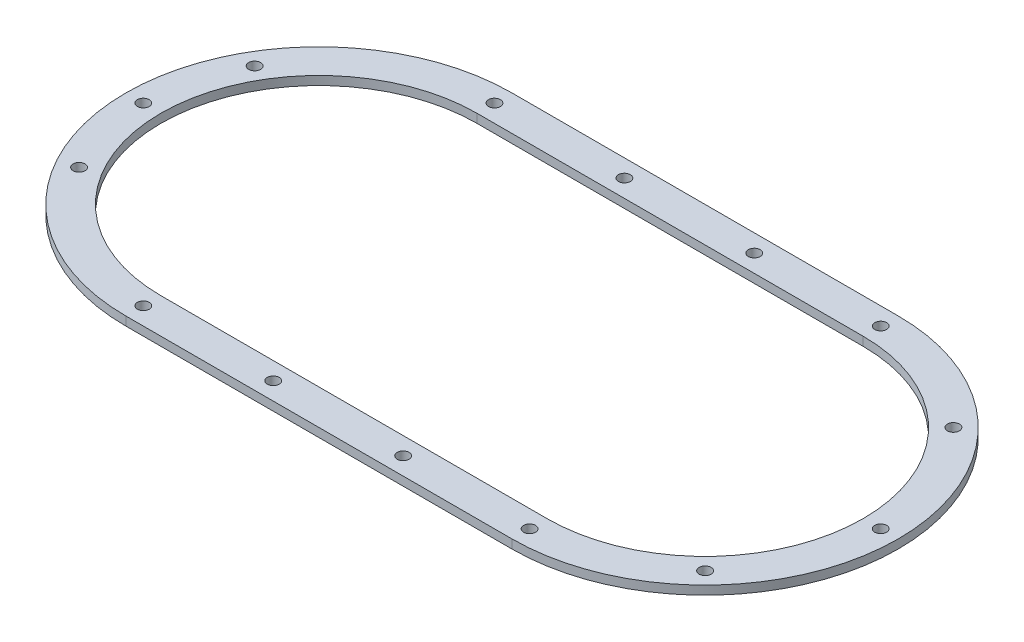
ISO-10303-21;
HEADER;
FILE_DESCRIPTION(('STEP AP214'),'2;1');
FILE_NAME('part.step','',(''),(''),'','','');
FILE_SCHEMA(('AUTOMOTIVE_DESIGN { 1 0 10303 214 1 1 1 1 }'));
ENDSEC;
DATA;
#1=APPLICATION_CONTEXT('core data for automotive mechanical design processes');
#2=APPLICATION_PROTOCOL_DEFINITION('international standard','automotive_design',2000,#1);
#3=PRODUCT_CONTEXT('',#1,'mechanical');
#4=PRODUCT('Part','Part','',(#3));
#5=PRODUCT_RELATED_PRODUCT_CATEGORY('part','',(#4));
#6=PRODUCT_DEFINITION_FORMATION('','',#4);
#7=PRODUCT_DEFINITION_CONTEXT('part definition',#1,'design');
#8=PRODUCT_DEFINITION('design','',#6,#7);
#9=PRODUCT_DEFINITION_SHAPE('','',#8);
#10=(LENGTH_UNIT() NAMED_UNIT(*) SI_UNIT(.MILLI.,.METRE.));
#11=(NAMED_UNIT(*) PLANE_ANGLE_UNIT() SI_UNIT($,.RADIAN.));
#12=(NAMED_UNIT(*) SI_UNIT($,.STERADIAN.) SOLID_ANGLE_UNIT());
#13=UNCERTAINTY_MEASURE_WITH_UNIT(LENGTH_MEASURE(1.E-05),#10,'distance_accuracy_value','');
#14=(GEOMETRIC_REPRESENTATION_CONTEXT(3) GLOBAL_UNCERTAINTY_ASSIGNED_CONTEXT((#13)) GLOBAL_UNIT_ASSIGNED_CONTEXT((#10,
#11,#12)) REPRESENTATION_CONTEXT('',''));
#15=CARTESIAN_POINT('',(0.,0.,0.));
#16=DIRECTION('',(0.,0.,1.));
#17=DIRECTION('',(1.,0.,0.));
#18=AXIS2_PLACEMENT_3D('',#15,#16,#17);
#19=CARTESIAN_POINT('',(0.,5.,0.));
#20=DIRECTION('',(0.,1.,0.));
#21=DIRECTION('',(0.,0.,1.));
#22=AXIS2_PLACEMENT_3D('',#19,#20,#21);
#23=PLANE('',#22);
#24=CARTESIAN_POINT('',(0.,5.,100.));
#25=DIRECTION('',(0.,1.,0.));
#26=DIRECTION('',(0.,0.,1.));
#27=AXIS2_PLACEMENT_3D('',#24,#25,#26);
#28=CIRCLE('',#27,3.4);
#29=CARTESIAN_POINT('',(0.,5.,103.4));
#30=VERTEX_POINT('',#29);
#31=EDGE_CURVE('E311',#30,#30,#28,.T.);
#32=ORIENTED_EDGE('',*,*,#31,.F.);
#33=EDGE_LOOP('',(#32));
#34=FACE_BOUND('',#33,.T.);
#35=CARTESIAN_POINT('',(220.,5.,-100.));
#36=DIRECTION('',(0.,1.,0.));
#37=DIRECTION('',(0.,0.,1.));
#38=AXIS2_PLACEMENT_3D('',#35,#36,#37);
#39=CIRCLE('',#38,3.39999999999999);
#40=CARTESIAN_POINT('',(220.,5.,-96.6));
#41=VERTEX_POINT('',#40);
#42=EDGE_CURVE('E316',#41,#41,#39,.T.);
#43=ORIENTED_EDGE('',*,*,#42,.F.);
#44=EDGE_LOOP('',(#43));
#45=FACE_BOUND('',#44,.T.);
#46=CARTESIAN_POINT('',(-100.,5.,0.));
#47=DIRECTION('',(0.,1.,0.));
#48=DIRECTION('',(0.,0.,1.));
#49=AXIS2_PLACEMENT_3D('',#46,#47,#48);
#50=CIRCLE('',#49,3.4);
#51=CARTESIAN_POINT('',(-100.,5.,3.39999999999999));
#52=VERTEX_POINT('',#51);
#53=EDGE_CURVE('E326',#52,#52,#50,.T.);
#54=ORIENTED_EDGE('',*,*,#53,.F.);
#55=EDGE_LOOP('',(#54));
#56=FACE_BOUND('',#55,.T.);
#57=CARTESIAN_POINT('',(-86.6025403784442,5.,-49.9999999999995));
#58=DIRECTION('',(0.,1.,0.));
#59=DIRECTION('',(0.,0.,1.));
#60=AXIS2_PLACEMENT_3D('',#57,#58,#59);
#61=CIRCLE('',#60,3.4);
#62=CARTESIAN_POINT('',(-86.6025403784442,5.,-46.5999999999995));
#63=VERTEX_POINT('',#62);
#64=EDGE_CURVE('E334',#63,#63,#61,.T.);
#65=ORIENTED_EDGE('',*,*,#64,.F.);
#66=EDGE_LOOP('',(#65));
#67=FACE_BOUND('',#66,.T.);
#68=CARTESIAN_POINT('',(0.,5.,-100.));
#69=DIRECTION('',(0.,1.,0.));
#70=DIRECTION('',(0.,0.,1.));
#71=AXIS2_PLACEMENT_3D('',#68,#69,#70);
#72=CIRCLE('',#71,3.4);
#73=CARTESIAN_POINT('',(0.,5.,-96.6));
#74=VERTEX_POINT('',#73);
#75=EDGE_CURVE('E342',#74,#74,#72,.T.);
#76=ORIENTED_EDGE('',*,*,#75,.F.);
#77=EDGE_LOOP('',(#76));
#78=FACE_BOUND('',#77,.T.);
#79=CARTESIAN_POINT('',(74.,5.,-100.));
#80=DIRECTION('',(0.,1.,0.));
#81=DIRECTION('',(0.,0.,1.));
#82=AXIS2_PLACEMENT_3D('',#79,#80,#81);
#83=CIRCLE('',#82,3.4);
#84=CARTESIAN_POINT('',(74.,5.,-96.6));
#85=VERTEX_POINT('',#84);
#86=EDGE_CURVE('E350',#85,#85,#83,.T.);
#87=ORIENTED_EDGE('',*,*,#86,.F.);
#88=EDGE_LOOP('',(#87));
#89=FACE_BOUND('',#88,.T.);
#90=CARTESIAN_POINT('',(148.,5.,-100.));
#91=DIRECTION('',(0.,1.,0.));
#92=DIRECTION('',(0.,0.,1.));
#93=AXIS2_PLACEMENT_3D('',#90,#91,#92);
#94=CIRCLE('',#93,3.39999999999999);
#95=CARTESIAN_POINT('',(148.,5.,-96.6));
#96=VERTEX_POINT('',#95);
#97=EDGE_CURVE('E358',#96,#96,#94,.T.);
#98=ORIENTED_EDGE('',*,*,#97,.F.);
#99=EDGE_LOOP('',(#98));
#100=FACE_BOUND('',#99,.T.);
#101=CARTESIAN_POINT('',(290.710678118655,5.,-70.7106781186549));
#102=DIRECTION('',(0.,1.,0.));
#103=DIRECTION('',(0.,0.,1.));
#104=AXIS2_PLACEMENT_3D('',#101,#102,#103);
#105=CIRCLE('',#104,3.40000000000001);
#106=CARTESIAN_POINT('',(290.710678118655,5.,-67.3106781186548));
#107=VERTEX_POINT('',#106);
#108=EDGE_CURVE('E366',#107,#107,#105,.T.);
#109=ORIENTED_EDGE('',*,*,#108,.F.);
#110=EDGE_LOOP('',(#109));
#111=FACE_BOUND('',#110,.T.);
#112=CARTESIAN_POINT('',(320.,5.,0.));
#113=DIRECTION('',(0.,1.,0.));
#114=DIRECTION('',(0.,0.,1.));
#115=AXIS2_PLACEMENT_3D('',#112,#113,#114);
#116=CIRCLE('',#115,3.40000000000001);
#117=CARTESIAN_POINT('',(320.,5.,3.40000000000001));
#118=VERTEX_POINT('',#117);
#119=EDGE_CURVE('E374',#118,#118,#116,.T.);
#120=ORIENTED_EDGE('',*,*,#119,.F.);
#121=EDGE_LOOP('',(#120));
#122=FACE_BOUND('',#121,.T.);
#123=CARTESIAN_POINT('',(290.710678118655,5.,70.7106781186549));
#124=DIRECTION('',(0.,1.,0.));
#125=DIRECTION('',(0.,0.,1.));
#126=AXIS2_PLACEMENT_3D('',#123,#124,#125);
#127=CIRCLE('',#126,3.40000000000001);
#128=CARTESIAN_POINT('',(290.710678118655,5.,74.1106781186549));
#129=VERTEX_POINT('',#128);
#130=EDGE_CURVE('E382',#129,#129,#127,.T.);
#131=ORIENTED_EDGE('',*,*,#130,.F.);
#132=EDGE_LOOP('',(#131));
#133=FACE_BOUND('',#132,.T.);
#134=CARTESIAN_POINT('',(220.,5.,100.));
#135=DIRECTION('',(0.,1.,0.));
#136=DIRECTION('',(0.,0.,1.));
#137=AXIS2_PLACEMENT_3D('',#134,#135,#136);
#138=CIRCLE('',#137,3.39999999999999);
#139=CARTESIAN_POINT('',(220.,5.,103.4));
#140=VERTEX_POINT('',#139);
#141=EDGE_CURVE('E390',#140,#140,#138,.T.);
#142=ORIENTED_EDGE('',*,*,#141,.F.);
#143=EDGE_LOOP('',(#142));
#144=FACE_BOUND('',#143,.T.);
#145=CARTESIAN_POINT('',(148.,5.,100.));
#146=DIRECTION('',(0.,1.,0.));
#147=DIRECTION('',(0.,0.,1.));
#148=AXIS2_PLACEMENT_3D('',#145,#146,#147);
#149=CIRCLE('',#148,3.39999999999999);
#150=CARTESIAN_POINT('',(148.,5.,103.4));
#151=VERTEX_POINT('',#150);
#152=EDGE_CURVE('E398',#151,#151,#149,.T.);
#153=ORIENTED_EDGE('',*,*,#152,.F.);
#154=EDGE_LOOP('',(#153));
#155=FACE_BOUND('',#154,.T.);
#156=CARTESIAN_POINT('',(74.,5.,100.));
#157=DIRECTION('',(0.,1.,0.));
#158=DIRECTION('',(0.,0.,1.));
#159=AXIS2_PLACEMENT_3D('',#156,#157,#158);
#160=CIRCLE('',#159,3.4);
#161=CARTESIAN_POINT('',(74.,5.,103.4));
#162=VERTEX_POINT('',#161);
#163=EDGE_CURVE('E406',#162,#162,#160,.T.);
#164=ORIENTED_EDGE('',*,*,#163,.F.);
#165=EDGE_LOOP('',(#164));
#166=FACE_BOUND('',#165,.T.);
#167=CARTESIAN_POINT('',(-86.6025403784442,5.,49.9999999999995));
#168=DIRECTION('',(0.,1.,0.));
#169=DIRECTION('',(0.,0.,1.));
#170=AXIS2_PLACEMENT_3D('',#167,#168,#169);
#171=CIRCLE('',#170,3.4);
#172=CARTESIAN_POINT('',(-86.6025403784442,5.,53.3999999999995));
#173=VERTEX_POINT('',#172);
#174=EDGE_CURVE('E414',#173,#173,#171,.T.);
#175=ORIENTED_EDGE('',*,*,#174,.F.);
#176=EDGE_LOOP('',(#175));
#177=FACE_BOUND('',#176,.T.);
#178=CARTESIAN_POINT('',(0.,5.,0.));
#179=DIRECTION('',(0.,1.,0.));
#180=DIRECTION('',(0.,0.,1.));
#181=AXIS2_PLACEMENT_3D('',#178,#179,#180);
#182=CIRCLE('',#181,110.);
#183=CARTESIAN_POINT('',(0.,5.,-110.));
#184=VERTEX_POINT('',#183);
#185=CARTESIAN_POINT('',(0.,5.,110.));
#186=VERTEX_POINT('',#185);
#187=EDGE_CURVE('E157',#184,#186,#182,.T.);
#188=ORIENTED_EDGE('',*,*,#187,.T.);
#189=DIRECTION('',(1.,0.,0.));
#190=VECTOR('',#189,1.);
#191=CARTESIAN_POINT('',(0.,5.,110.));
#192=LINE('',#191,#190);
#193=CARTESIAN_POINT('',(220.,5.,110.));
#194=VERTEX_POINT('',#193);
#195=EDGE_CURVE('E161',#186,#194,#192,.T.);
#196=ORIENTED_EDGE('',*,*,#195,.T.);
#197=CARTESIAN_POINT('',(220.,5.,0.));
#198=DIRECTION('',(0.,1.,0.));
#199=DIRECTION('',(0.,0.,1.));
#200=AXIS2_PLACEMENT_3D('',#197,#198,#199);
#201=CIRCLE('',#200,110.);
#202=CARTESIAN_POINT('',(220.,5.,-110.));
#203=VERTEX_POINT('',#202);
#204=EDGE_CURVE('E165',#194,#203,#201,.T.);
#205=ORIENTED_EDGE('',*,*,#204,.T.);
#206=DIRECTION('',(-1.,0.,0.));
#207=VECTOR('',#206,1.);
#208=CARTESIAN_POINT('',(0.,5.,-110.));
#209=LINE('',#208,#207);
#210=EDGE_CURVE('E168',#203,#184,#209,.T.);
#211=ORIENTED_EDGE('',*,*,#210,.T.);
#212=EDGE_LOOP('',(#188,#196,#205,#211));
#213=FACE_BOUND('',#212,.T.);
#214=DIRECTION('',(1.,0.,0.));
#215=VECTOR('',#214,1.);
#216=CARTESIAN_POINT('',(0.,5.,90.));
#217=LINE('',#216,#215);
#218=CARTESIAN_POINT('',(0.,5.,90.));
#219=VERTEX_POINT('',#218);
#220=CARTESIAN_POINT('',(220.,5.,90.));
#221=VERTEX_POINT('',#220);
#222=EDGE_CURVE('E115',#219,#221,#217,.T.);
#223=ORIENTED_EDGE('',*,*,#222,.F.);
#224=CARTESIAN_POINT('',(0.,5.,0.));
#225=DIRECTION('',(0.,1.,0.));
#226=DIRECTION('',(0.,0.,1.));
#227=AXIS2_PLACEMENT_3D('',#224,#225,#226);
#228=CIRCLE('',#227,90.);
#229=CARTESIAN_POINT('',(0.,5.,-90.));
#230=VERTEX_POINT('',#229);
#231=EDGE_CURVE('E106',#230,#219,#228,.T.);
#232=ORIENTED_EDGE('',*,*,#231,.F.);
#233=DIRECTION('',(-1.,0.,0.));
#234=VECTOR('',#233,1.);
#235=CARTESIAN_POINT('',(0.,5.,-90.));
#236=LINE('',#235,#234);
#237=CARTESIAN_POINT('',(220.,5.,-90.));
#238=VERTEX_POINT('',#237);
#239=EDGE_CURVE('E133',#238,#230,#236,.T.);
#240=ORIENTED_EDGE('',*,*,#239,.F.);
#241=CARTESIAN_POINT('',(220.,5.,0.));
#242=DIRECTION('',(0.,1.,0.));
#243=DIRECTION('',(0.,0.,1.));
#244=AXIS2_PLACEMENT_3D('',#241,#242,#243);
#245=CIRCLE('',#244,90.);
#246=EDGE_CURVE('E128',#221,#238,#245,.T.);
#247=ORIENTED_EDGE('',*,*,#246,.F.);
#248=EDGE_LOOP('',(#223,#232,#240,#247));
#249=FACE_BOUND('',#248,.T.);
#250=ADVANCED_FACE('F40',(#34,#45,#56,#67,#78,#89,#100,#111,#122,#133,#144,#155,#166,#177,#213,
#249),#23,.T.);
#251=CARTESIAN_POINT('',(0.,0.,0.));
#252=DIRECTION('',(0.,1.,0.));
#253=DIRECTION('',(0.,0.,1.));
#254=AXIS2_PLACEMENT_3D('',#251,#252,#253);
#255=PLANE('',#254);
#256=CARTESIAN_POINT('',(0.,0.,100.));
#257=DIRECTION('',(0.,1.,0.));
#258=DIRECTION('',(0.,0.,1.));
#259=AXIS2_PLACEMENT_3D('',#256,#257,#258);
#260=CIRCLE('',#259,3.4);
#261=CARTESIAN_POINT('',(0.,0.,103.4));
#262=VERTEX_POINT('',#261);
#263=EDGE_CURVE('E309',#262,#262,#260,.T.);
#264=ORIENTED_EDGE('',*,*,#263,.T.);
#265=EDGE_LOOP('',(#264));
#266=FACE_BOUND('',#265,.T.);
#267=CARTESIAN_POINT('',(220.,0.,-100.));
#268=DIRECTION('',(0.,1.,0.));
#269=DIRECTION('',(0.,0.,1.));
#270=AXIS2_PLACEMENT_3D('',#267,#268,#269);
#271=CIRCLE('',#270,3.39999999999999);
#272=CARTESIAN_POINT('',(220.,0.,-96.6));
#273=VERTEX_POINT('',#272);
#274=EDGE_CURVE('E322',#273,#273,#271,.T.);
#275=ORIENTED_EDGE('',*,*,#274,.T.);
#276=EDGE_LOOP('',(#275));
#277=FACE_BOUND('',#276,.T.);
#278=CARTESIAN_POINT('',(-100.,0.,0.));
#279=DIRECTION('',(0.,1.,0.));
#280=DIRECTION('',(0.,0.,1.));
#281=AXIS2_PLACEMENT_3D('',#278,#279,#280);
#282=CIRCLE('',#281,3.4);
#283=CARTESIAN_POINT('',(-100.,0.,3.39999999999999));
#284=VERTEX_POINT('',#283);
#285=EDGE_CURVE('E330',#284,#284,#282,.T.);
#286=ORIENTED_EDGE('',*,*,#285,.T.);
#287=EDGE_LOOP('',(#286));
#288=FACE_BOUND('',#287,.T.);
#289=CARTESIAN_POINT('',(-86.6025403784442,0.,-49.9999999999995));
#290=DIRECTION('',(0.,1.,0.));
#291=DIRECTION('',(0.,0.,1.));
#292=AXIS2_PLACEMENT_3D('',#289,#290,#291);
#293=CIRCLE('',#292,3.4);
#294=CARTESIAN_POINT('',(-86.6025403784442,0.,-46.5999999999995));
#295=VERTEX_POINT('',#294);
#296=EDGE_CURVE('E338',#295,#295,#293,.T.);
#297=ORIENTED_EDGE('',*,*,#296,.T.);
#298=EDGE_LOOP('',(#297));
#299=FACE_BOUND('',#298,.T.);
#300=CARTESIAN_POINT('',(0.,0.,-100.));
#301=DIRECTION('',(0.,1.,0.));
#302=DIRECTION('',(0.,0.,1.));
#303=AXIS2_PLACEMENT_3D('',#300,#301,#302);
#304=CIRCLE('',#303,3.4);
#305=CARTESIAN_POINT('',(0.,0.,-96.6));
#306=VERTEX_POINT('',#305);
#307=EDGE_CURVE('E346',#306,#306,#304,.T.);
#308=ORIENTED_EDGE('',*,*,#307,.T.);
#309=EDGE_LOOP('',(#308));
#310=FACE_BOUND('',#309,.T.);
#311=CARTESIAN_POINT('',(74.,0.,-100.));
#312=DIRECTION('',(0.,1.,0.));
#313=DIRECTION('',(0.,0.,1.));
#314=AXIS2_PLACEMENT_3D('',#311,#312,#313);
#315=CIRCLE('',#314,3.4);
#316=CARTESIAN_POINT('',(74.,0.,-96.6));
#317=VERTEX_POINT('',#316);
#318=EDGE_CURVE('E354',#317,#317,#315,.T.);
#319=ORIENTED_EDGE('',*,*,#318,.T.);
#320=EDGE_LOOP('',(#319));
#321=FACE_BOUND('',#320,.T.);
#322=CARTESIAN_POINT('',(148.,0.,-100.));
#323=DIRECTION('',(0.,1.,0.));
#324=DIRECTION('',(0.,0.,1.));
#325=AXIS2_PLACEMENT_3D('',#322,#323,#324);
#326=CIRCLE('',#325,3.39999999999999);
#327=CARTESIAN_POINT('',(148.,0.,-96.6));
#328=VERTEX_POINT('',#327);
#329=EDGE_CURVE('E362',#328,#328,#326,.T.);
#330=ORIENTED_EDGE('',*,*,#329,.T.);
#331=EDGE_LOOP('',(#330));
#332=FACE_BOUND('',#331,.T.);
#333=CARTESIAN_POINT('',(290.710678118655,0.,-70.7106781186549));
#334=DIRECTION('',(0.,1.,0.));
#335=DIRECTION('',(0.,0.,1.));
#336=AXIS2_PLACEMENT_3D('',#333,#334,#335);
#337=CIRCLE('',#336,3.40000000000001);
#338=CARTESIAN_POINT('',(290.710678118655,0.,-67.3106781186548));
#339=VERTEX_POINT('',#338);
#340=EDGE_CURVE('E370',#339,#339,#337,.T.);
#341=ORIENTED_EDGE('',*,*,#340,.T.);
#342=EDGE_LOOP('',(#341));
#343=FACE_BOUND('',#342,.T.);
#344=CARTESIAN_POINT('',(320.,0.,0.));
#345=DIRECTION('',(0.,1.,0.));
#346=DIRECTION('',(0.,0.,1.));
#347=AXIS2_PLACEMENT_3D('',#344,#345,#346);
#348=CIRCLE('',#347,3.40000000000001);
#349=CARTESIAN_POINT('',(320.,0.,3.40000000000001));
#350=VERTEX_POINT('',#349);
#351=EDGE_CURVE('E378',#350,#350,#348,.T.);
#352=ORIENTED_EDGE('',*,*,#351,.T.);
#353=EDGE_LOOP('',(#352));
#354=FACE_BOUND('',#353,.T.);
#355=CARTESIAN_POINT('',(290.710678118655,0.,70.7106781186549));
#356=DIRECTION('',(0.,1.,0.));
#357=DIRECTION('',(0.,0.,1.));
#358=AXIS2_PLACEMENT_3D('',#355,#356,#357);
#359=CIRCLE('',#358,3.40000000000001);
#360=CARTESIAN_POINT('',(290.710678118655,0.,74.1106781186549));
#361=VERTEX_POINT('',#360);
#362=EDGE_CURVE('E386',#361,#361,#359,.T.);
#363=ORIENTED_EDGE('',*,*,#362,.T.);
#364=EDGE_LOOP('',(#363));
#365=FACE_BOUND('',#364,.T.);
#366=CARTESIAN_POINT('',(220.,0.,100.));
#367=DIRECTION('',(0.,1.,0.));
#368=DIRECTION('',(0.,0.,1.));
#369=AXIS2_PLACEMENT_3D('',#366,#367,#368);
#370=CIRCLE('',#369,3.39999999999999);
#371=CARTESIAN_POINT('',(220.,0.,103.4));
#372=VERTEX_POINT('',#371);
#373=EDGE_CURVE('E394',#372,#372,#370,.T.);
#374=ORIENTED_EDGE('',*,*,#373,.T.);
#375=EDGE_LOOP('',(#374));
#376=FACE_BOUND('',#375,.T.);
#377=CARTESIAN_POINT('',(148.,0.,100.));
#378=DIRECTION('',(0.,1.,0.));
#379=DIRECTION('',(0.,0.,1.));
#380=AXIS2_PLACEMENT_3D('',#377,#378,#379);
#381=CIRCLE('',#380,3.39999999999999);
#382=CARTESIAN_POINT('',(148.,0.,103.4));
#383=VERTEX_POINT('',#382);
#384=EDGE_CURVE('E402',#383,#383,#381,.T.);
#385=ORIENTED_EDGE('',*,*,#384,.T.);
#386=EDGE_LOOP('',(#385));
#387=FACE_BOUND('',#386,.T.);
#388=CARTESIAN_POINT('',(74.,0.,100.));
#389=DIRECTION('',(0.,1.,0.));
#390=DIRECTION('',(0.,0.,1.));
#391=AXIS2_PLACEMENT_3D('',#388,#389,#390);
#392=CIRCLE('',#391,3.4);
#393=CARTESIAN_POINT('',(74.,0.,103.4));
#394=VERTEX_POINT('',#393);
#395=EDGE_CURVE('E410',#394,#394,#392,.T.);
#396=ORIENTED_EDGE('',*,*,#395,.T.);
#397=EDGE_LOOP('',(#396));
#398=FACE_BOUND('',#397,.T.);
#399=CARTESIAN_POINT('',(-86.6025403784442,0.,49.9999999999995));
#400=DIRECTION('',(0.,1.,0.));
#401=DIRECTION('',(0.,0.,1.));
#402=AXIS2_PLACEMENT_3D('',#399,#400,#401);
#403=CIRCLE('',#402,3.4);
#404=CARTESIAN_POINT('',(-86.6025403784442,0.,53.3999999999995));
#405=VERTEX_POINT('',#404);
#406=EDGE_CURVE('E141',#405,#405,#403,.T.);
#407=ORIENTED_EDGE('',*,*,#406,.T.);
#408=EDGE_LOOP('',(#407));
#409=FACE_BOUND('',#408,.T.);
#410=CARTESIAN_POINT('',(0.,0.,0.));
#411=DIRECTION('',(0.,1.,0.));
#412=DIRECTION('',(0.,0.,1.));
#413=AXIS2_PLACEMENT_3D('',#410,#411,#412);
#414=CIRCLE('',#413,110.);
#415=CARTESIAN_POINT('',(0.,0.,-110.));
#416=VERTEX_POINT('',#415);
#417=CARTESIAN_POINT('',(0.,0.,110.));
#418=VERTEX_POINT('',#417);
#419=EDGE_CURVE('E124',#416,#418,#414,.T.);
#420=ORIENTED_EDGE('',*,*,#419,.F.);
#421=DIRECTION('',(-1.,0.,0.));
#422=VECTOR('',#421,1.);
#423=CARTESIAN_POINT('',(0.,0.,-110.));
#424=LINE('',#423,#422);
#425=CARTESIAN_POINT('',(220.,0.,-110.));
#426=VERTEX_POINT('',#425);
#427=EDGE_CURVE('E162',#426,#416,#424,.T.);
#428=ORIENTED_EDGE('',*,*,#427,.F.);
#429=CARTESIAN_POINT('',(220.,0.,0.));
#430=DIRECTION('',(0.,1.,0.));
#431=DIRECTION('',(0.,0.,1.));
#432=AXIS2_PLACEMENT_3D('',#429,#430,#431);
#433=CIRCLE('',#432,110.);
#434=CARTESIAN_POINT('',(220.,0.,110.));
#435=VERTEX_POINT('',#434);
#436=EDGE_CURVE('E178',#435,#426,#433,.T.);
#437=ORIENTED_EDGE('',*,*,#436,.F.);
#438=DIRECTION('',(1.,0.,0.));
#439=VECTOR('',#438,1.);
#440=CARTESIAN_POINT('',(0.,0.,110.));
#441=LINE('',#440,#439);
#442=EDGE_CURVE('E175',#418,#435,#441,.T.);
#443=ORIENTED_EDGE('',*,*,#442,.F.);
#444=EDGE_LOOP('',(#420,#428,#437,#443));
#445=FACE_BOUND('',#444,.T.);
#446=CARTESIAN_POINT('',(0.,0.,0.));
#447=DIRECTION('',(0.,1.,0.));
#448=DIRECTION('',(0.,0.,1.));
#449=AXIS2_PLACEMENT_3D('',#446,#447,#448);
#450=CIRCLE('',#449,90.);
#451=CARTESIAN_POINT('',(0.,0.,-90.));
#452=VERTEX_POINT('',#451);
#453=CARTESIAN_POINT('',(0.,0.,90.));
#454=VERTEX_POINT('',#453);
#455=EDGE_CURVE('E64',#452,#454,#450,.T.);
#456=ORIENTED_EDGE('',*,*,#455,.T.);
#457=DIRECTION('',(1.,0.,0.));
#458=VECTOR('',#457,1.);
#459=CARTESIAN_POINT('',(0.,0.,90.));
#460=LINE('',#459,#458);
#461=CARTESIAN_POINT('',(220.,0.,90.));
#462=VERTEX_POINT('',#461);
#463=EDGE_CURVE('E122',#454,#462,#460,.T.);
#464=ORIENTED_EDGE('',*,*,#463,.T.);
#465=CARTESIAN_POINT('',(220.,0.,0.));
#466=DIRECTION('',(0.,1.,0.));
#467=DIRECTION('',(0.,0.,1.));
#468=AXIS2_PLACEMENT_3D('',#465,#466,#467);
#469=CIRCLE('',#468,90.);
#470=CARTESIAN_POINT('',(220.,0.,-90.));
#471=VERTEX_POINT('',#470);
#472=EDGE_CURVE('E144',#462,#471,#469,.T.);
#473=ORIENTED_EDGE('',*,*,#472,.T.);
#474=DIRECTION('',(-1.,0.,0.));
#475=VECTOR('',#474,1.);
#476=CARTESIAN_POINT('',(0.,0.,-90.));
#477=LINE('',#476,#475);
#478=EDGE_CURVE('E116',#471,#452,#477,.T.);
#479=ORIENTED_EDGE('',*,*,#478,.T.);
#480=EDGE_LOOP('',(#456,#464,#473,#479));
#481=FACE_BOUND('',#480,.T.);
#482=ADVANCED_FACE('F202',(#266,#277,#288,#299,#310,#321,#332,#343,#354,#365,#376,#387,#398,
#409,#445,#481),#255,.F.);
#483=CARTESIAN_POINT('',(0.,5.,0.));
#484=DIRECTION('',(0.,-1.,0.));
#485=DIRECTION('',(0.,0.,-1.));
#486=AXIS2_PLACEMENT_3D('',#483,#484,#485);
#487=CYLINDRICAL_SURFACE('',#486,110.);
#488=ORIENTED_EDGE('',*,*,#419,.T.);
#489=DIRECTION('',(0.,-1.,0.));
#490=VECTOR('',#489,1.);
#491=CARTESIAN_POINT('',(0.,5.,110.));
#492=LINE('',#491,#490);
#493=EDGE_CURVE('E11',#186,#418,#492,.T.);
#494=ORIENTED_EDGE('',*,*,#493,.F.);
#495=ORIENTED_EDGE('',*,*,#187,.F.);
#496=DIRECTION('',(0.,-1.,0.));
#497=VECTOR('',#496,1.);
#498=CARTESIAN_POINT('',(0.,5.,-110.));
#499=LINE('',#498,#497);
#500=EDGE_CURVE('E171',#184,#416,#499,.T.);
#501=ORIENTED_EDGE('',*,*,#500,.T.);
#502=EDGE_LOOP('',(#488,#494,#495,#501));
#503=FACE_BOUND('',#502,.T.);
#504=ADVANCED_FACE('F42',(#503),#487,.T.);
#505=CARTESIAN_POINT('',(0.,5.,110.));
#506=DIRECTION('',(0.,0.,-1.));
#507=DIRECTION('',(-1.,0.,0.));
#508=AXIS2_PLACEMENT_3D('',#505,#506,#507);
#509=PLANE('',#508);
#510=ORIENTED_EDGE('',*,*,#442,.T.);
#511=DIRECTION('',(0.,-1.,0.));
#512=VECTOR('',#511,1.);
#513=CARTESIAN_POINT('',(220.,5.,110.));
#514=LINE('',#513,#512);
#515=EDGE_CURVE('E49',#194,#435,#514,.T.);
#516=ORIENTED_EDGE('',*,*,#515,.F.);
#517=ORIENTED_EDGE('',*,*,#195,.F.);
#518=ORIENTED_EDGE('',*,*,#493,.T.);
#519=EDGE_LOOP('',(#510,#516,#517,#518));
#520=FACE_BOUND('',#519,.T.);
#521=ADVANCED_FACE('F212',(#520),#509,.F.);
#522=CARTESIAN_POINT('',(220.,5.,0.));
#523=DIRECTION('',(0.,-1.,0.));
#524=DIRECTION('',(0.,0.,-1.));
#525=AXIS2_PLACEMENT_3D('',#522,#523,#524);
#526=CYLINDRICAL_SURFACE('',#525,110.);
#527=ORIENTED_EDGE('',*,*,#436,.T.);
#528=DIRECTION('',(0.,-1.,0.));
#529=VECTOR('',#528,1.);
#530=CARTESIAN_POINT('',(220.,5.,-110.));
#531=LINE('',#530,#529);
#532=EDGE_CURVE('E186',#203,#426,#531,.T.);
#533=ORIENTED_EDGE('',*,*,#532,.F.);
#534=ORIENTED_EDGE('',*,*,#204,.F.);
#535=ORIENTED_EDGE('',*,*,#515,.T.);
#536=EDGE_LOOP('',(#527,#533,#534,#535));
#537=FACE_BOUND('',#536,.T.);
#538=ADVANCED_FACE('F196',(#537),#526,.T.);
#539=CARTESIAN_POINT('',(0.,5.,-110.));
#540=DIRECTION('',(0.,0.,1.));
#541=DIRECTION('',(1.,0.,0.));
#542=AXIS2_PLACEMENT_3D('',#539,#540,#541);
#543=PLANE('',#542);
#544=ORIENTED_EDGE('',*,*,#427,.T.);
#545=ORIENTED_EDGE('',*,*,#500,.F.);
#546=ORIENTED_EDGE('',*,*,#210,.F.);
#547=ORIENTED_EDGE('',*,*,#532,.T.);
#548=EDGE_LOOP('',(#544,#545,#546,#547));
#549=FACE_BOUND('',#548,.T.);
#550=ADVANCED_FACE('F206',(#549),#543,.F.);
#551=CARTESIAN_POINT('',(0.,5.,0.));
#552=DIRECTION('',(0.,-1.,0.));
#553=DIRECTION('',(0.,0.,-1.));
#554=AXIS2_PLACEMENT_3D('',#551,#552,#553);
#555=CYLINDRICAL_SURFACE('',#554,90.);
#556=ORIENTED_EDGE('',*,*,#455,.F.);
#557=DIRECTION('',(0.,-1.,0.));
#558=VECTOR('',#557,1.);
#559=CARTESIAN_POINT('',(0.,5.,-90.));
#560=LINE('',#559,#558);
#561=EDGE_CURVE('E110',#230,#452,#560,.T.);
#562=ORIENTED_EDGE('',*,*,#561,.F.);
#563=ORIENTED_EDGE('',*,*,#231,.T.);
#564=DIRECTION('',(0.,-1.,0.));
#565=VECTOR('',#564,1.);
#566=CARTESIAN_POINT('',(0.,5.,90.));
#567=LINE('',#566,#565);
#568=EDGE_CURVE('E109',#219,#454,#567,.T.);
#569=ORIENTED_EDGE('',*,*,#568,.T.);
#570=EDGE_LOOP('',(#556,#562,#563,#569));
#571=FACE_BOUND('',#570,.T.);
#572=ADVANCED_FACE('F108',(#571),#555,.F.);
#573=CARTESIAN_POINT('',(0.,5.,90.));
#574=DIRECTION('',(0.,0.,-1.));
#575=DIRECTION('',(-1.,0.,0.));
#576=AXIS2_PLACEMENT_3D('',#573,#574,#575);
#577=PLANE('',#576);
#578=ORIENTED_EDGE('',*,*,#463,.F.);
#579=ORIENTED_EDGE('',*,*,#568,.F.);
#580=ORIENTED_EDGE('',*,*,#222,.T.);
#581=DIRECTION('',(0.,-1.,0.));
#582=VECTOR('',#581,1.);
#583=CARTESIAN_POINT('',(220.,5.,90.));
#584=LINE('',#583,#582);
#585=EDGE_CURVE('E125',#221,#462,#584,.T.);
#586=ORIENTED_EDGE('',*,*,#585,.T.);
#587=EDGE_LOOP('',(#578,#579,#580,#586));
#588=FACE_BOUND('',#587,.T.);
#589=ADVANCED_FACE('F119',(#588),#577,.T.);
#590=CARTESIAN_POINT('',(220.,5.,0.));
#591=DIRECTION('',(0.,-1.,0.));
#592=DIRECTION('',(0.,0.,-1.));
#593=AXIS2_PLACEMENT_3D('',#590,#591,#592);
#594=CYLINDRICAL_SURFACE('',#593,90.);
#595=ORIENTED_EDGE('',*,*,#472,.F.);
#596=ORIENTED_EDGE('',*,*,#585,.F.);
#597=ORIENTED_EDGE('',*,*,#246,.T.);
#598=DIRECTION('',(0.,-1.,0.));
#599=VECTOR('',#598,1.);
#600=CARTESIAN_POINT('',(220.,5.,-90.));
#601=LINE('',#600,#599);
#602=EDGE_CURVE('E56',#238,#471,#601,.T.);
#603=ORIENTED_EDGE('',*,*,#602,.T.);
#604=EDGE_LOOP('',(#595,#596,#597,#603));
#605=FACE_BOUND('',#604,.T.);
#606=ADVANCED_FACE('F239',(#605),#594,.F.);
#607=CARTESIAN_POINT('',(0.,5.,-90.));
#608=DIRECTION('',(0.,0.,1.));
#609=DIRECTION('',(1.,0.,0.));
#610=AXIS2_PLACEMENT_3D('',#607,#608,#609);
#611=PLANE('',#610);
#612=ORIENTED_EDGE('',*,*,#478,.F.);
#613=ORIENTED_EDGE('',*,*,#602,.F.);
#614=ORIENTED_EDGE('',*,*,#239,.T.);
#615=ORIENTED_EDGE('',*,*,#561,.T.);
#616=EDGE_LOOP('',(#612,#613,#614,#615));
#617=FACE_BOUND('',#616,.T.);
#618=ADVANCED_FACE('F243',(#617),#611,.T.);
#619=CARTESIAN_POINT('',(-86.6025403784442,5.,49.9999999999995));
#620=DIRECTION('',(0.,1.,0.));
#621=DIRECTION('',(0.,0.,1.));
#622=AXIS2_PLACEMENT_3D('',#619,#620,#621);
#623=CYLINDRICAL_SURFACE('',#622,3.4);
#624=ORIENTED_EDGE('',*,*,#406,.F.);
#625=EDGE_LOOP('',(#624));
#626=FACE_BOUND('',#625,.T.);
#627=ORIENTED_EDGE('',*,*,#174,.T.);
#628=EDGE_LOOP('',(#627));
#629=FACE_BOUND('',#628,.T.);
#630=ADVANCED_FACE('F249',(#626,#629),#623,.F.);
#631=CARTESIAN_POINT('',(74.,5.,100.));
#632=DIRECTION('',(0.,1.,0.));
#633=DIRECTION('',(0.,0.,1.));
#634=AXIS2_PLACEMENT_3D('',#631,#632,#633);
#635=CYLINDRICAL_SURFACE('',#634,3.4);
#636=ORIENTED_EDGE('',*,*,#395,.F.);
#637=EDGE_LOOP('',(#636));
#638=FACE_BOUND('',#637,.T.);
#639=ORIENTED_EDGE('',*,*,#163,.T.);
#640=EDGE_LOOP('',(#639));
#641=FACE_BOUND('',#640,.T.);
#642=ADVANCED_FACE('F252',(#638,#641),#635,.F.);
#643=CARTESIAN_POINT('',(148.,5.,100.));
#644=DIRECTION('',(0.,1.,0.));
#645=DIRECTION('',(0.,0.,1.));
#646=AXIS2_PLACEMENT_3D('',#643,#644,#645);
#647=CYLINDRICAL_SURFACE('',#646,3.39999999999999);
#648=ORIENTED_EDGE('',*,*,#384,.F.);
#649=EDGE_LOOP('',(#648));
#650=FACE_BOUND('',#649,.T.);
#651=ORIENTED_EDGE('',*,*,#152,.T.);
#652=EDGE_LOOP('',(#651));
#653=FACE_BOUND('',#652,.T.);
#654=ADVANCED_FACE('F256',(#650,#653),#647,.F.);
#655=CARTESIAN_POINT('',(220.,5.,100.));
#656=DIRECTION('',(0.,1.,0.));
#657=DIRECTION('',(0.,0.,1.));
#658=AXIS2_PLACEMENT_3D('',#655,#656,#657);
#659=CYLINDRICAL_SURFACE('',#658,3.39999999999999);
#660=ORIENTED_EDGE('',*,*,#373,.F.);
#661=EDGE_LOOP('',(#660));
#662=FACE_BOUND('',#661,.T.);
#663=ORIENTED_EDGE('',*,*,#141,.T.);
#664=EDGE_LOOP('',(#663));
#665=FACE_BOUND('',#664,.T.);
#666=ADVANCED_FACE('F260',(#662,#665),#659,.F.);
#667=CARTESIAN_POINT('',(290.710678118655,5.,70.7106781186549));
#668=DIRECTION('',(0.,1.,0.));
#669=DIRECTION('',(0.,0.,1.));
#670=AXIS2_PLACEMENT_3D('',#667,#668,#669);
#671=CYLINDRICAL_SURFACE('',#670,3.40000000000001);
#672=ORIENTED_EDGE('',*,*,#362,.F.);
#673=EDGE_LOOP('',(#672));
#674=FACE_BOUND('',#673,.T.);
#675=ORIENTED_EDGE('',*,*,#130,.T.);
#676=EDGE_LOOP('',(#675));
#677=FACE_BOUND('',#676,.T.);
#678=ADVANCED_FACE('F264',(#674,#677),#671,.F.);
#679=CARTESIAN_POINT('',(320.,5.,0.));
#680=DIRECTION('',(0.,1.,0.));
#681=DIRECTION('',(0.,0.,1.));
#682=AXIS2_PLACEMENT_3D('',#679,#680,#681);
#683=CYLINDRICAL_SURFACE('',#682,3.40000000000001);
#684=ORIENTED_EDGE('',*,*,#351,.F.);
#685=EDGE_LOOP('',(#684));
#686=FACE_BOUND('',#685,.T.);
#687=ORIENTED_EDGE('',*,*,#119,.T.);
#688=EDGE_LOOP('',(#687));
#689=FACE_BOUND('',#688,.T.);
#690=ADVANCED_FACE('F268',(#686,#689),#683,.F.);
#691=CARTESIAN_POINT('',(290.710678118655,5.,-70.7106781186549));
#692=DIRECTION('',(0.,1.,0.));
#693=DIRECTION('',(0.,0.,1.));
#694=AXIS2_PLACEMENT_3D('',#691,#692,#693);
#695=CYLINDRICAL_SURFACE('',#694,3.40000000000001);
#696=ORIENTED_EDGE('',*,*,#340,.F.);
#697=EDGE_LOOP('',(#696));
#698=FACE_BOUND('',#697,.T.);
#699=ORIENTED_EDGE('',*,*,#108,.T.);
#700=EDGE_LOOP('',(#699));
#701=FACE_BOUND('',#700,.T.);
#702=ADVANCED_FACE('F272',(#698,#701),#695,.F.);
#703=CARTESIAN_POINT('',(148.,5.,-100.));
#704=DIRECTION('',(0.,1.,0.));
#705=DIRECTION('',(0.,0.,1.));
#706=AXIS2_PLACEMENT_3D('',#703,#704,#705);
#707=CYLINDRICAL_SURFACE('',#706,3.39999999999999);
#708=ORIENTED_EDGE('',*,*,#329,.F.);
#709=EDGE_LOOP('',(#708));
#710=FACE_BOUND('',#709,.T.);
#711=ORIENTED_EDGE('',*,*,#97,.T.);
#712=EDGE_LOOP('',(#711));
#713=FACE_BOUND('',#712,.T.);
#714=ADVANCED_FACE('F276',(#710,#713),#707,.F.);
#715=CARTESIAN_POINT('',(74.,5.,-100.));
#716=DIRECTION('',(0.,1.,0.));
#717=DIRECTION('',(0.,0.,1.));
#718=AXIS2_PLACEMENT_3D('',#715,#716,#717);
#719=CYLINDRICAL_SURFACE('',#718,3.4);
#720=ORIENTED_EDGE('',*,*,#318,.F.);
#721=EDGE_LOOP('',(#720));
#722=FACE_BOUND('',#721,.T.);
#723=ORIENTED_EDGE('',*,*,#86,.T.);
#724=EDGE_LOOP('',(#723));
#725=FACE_BOUND('',#724,.T.);
#726=ADVANCED_FACE('F280',(#722,#725),#719,.F.);
#727=CARTESIAN_POINT('',(0.,5.,-100.));
#728=DIRECTION('',(0.,1.,0.));
#729=DIRECTION('',(0.,0.,1.));
#730=AXIS2_PLACEMENT_3D('',#727,#728,#729);
#731=CYLINDRICAL_SURFACE('',#730,3.4);
#732=ORIENTED_EDGE('',*,*,#307,.F.);
#733=EDGE_LOOP('',(#732));
#734=FACE_BOUND('',#733,.T.);
#735=ORIENTED_EDGE('',*,*,#75,.T.);
#736=EDGE_LOOP('',(#735));
#737=FACE_BOUND('',#736,.T.);
#738=ADVANCED_FACE('F284',(#734,#737),#731,.F.);
#739=CARTESIAN_POINT('',(-86.6025403784442,5.,-49.9999999999995));
#740=DIRECTION('',(0.,1.,0.));
#741=DIRECTION('',(0.,0.,1.));
#742=AXIS2_PLACEMENT_3D('',#739,#740,#741);
#743=CYLINDRICAL_SURFACE('',#742,3.4);
#744=ORIENTED_EDGE('',*,*,#296,.F.);
#745=EDGE_LOOP('',(#744));
#746=FACE_BOUND('',#745,.T.);
#747=ORIENTED_EDGE('',*,*,#64,.T.);
#748=EDGE_LOOP('',(#747));
#749=FACE_BOUND('',#748,.T.);
#750=ADVANCED_FACE('F288',(#746,#749),#743,.F.);
#751=CARTESIAN_POINT('',(-100.,5.,0.));
#752=DIRECTION('',(0.,1.,0.));
#753=DIRECTION('',(0.,0.,1.));
#754=AXIS2_PLACEMENT_3D('',#751,#752,#753);
#755=CYLINDRICAL_SURFACE('',#754,3.4);
#756=ORIENTED_EDGE('',*,*,#285,.F.);
#757=EDGE_LOOP('',(#756));
#758=FACE_BOUND('',#757,.T.);
#759=ORIENTED_EDGE('',*,*,#53,.T.);
#760=EDGE_LOOP('',(#759));
#761=FACE_BOUND('',#760,.T.);
#762=ADVANCED_FACE('F292',(#758,#761),#755,.F.);
#763=CARTESIAN_POINT('',(220.,5.,-100.));
#764=DIRECTION('',(0.,1.,0.));
#765=DIRECTION('',(0.,0.,1.));
#766=AXIS2_PLACEMENT_3D('',#763,#764,#765);
#767=CYLINDRICAL_SURFACE('',#766,3.39999999999999);
#768=ORIENTED_EDGE('',*,*,#274,.F.);
#769=EDGE_LOOP('',(#768));
#770=FACE_BOUND('',#769,.T.);
#771=ORIENTED_EDGE('',*,*,#42,.T.);
#772=EDGE_LOOP('',(#771));
#773=FACE_BOUND('',#772,.T.);
#774=ADVANCED_FACE('F296',(#770,#773),#767,.F.);
#775=CARTESIAN_POINT('',(0.,5.,100.));
#776=DIRECTION('',(0.,1.,0.));
#777=DIRECTION('',(0.,0.,1.));
#778=AXIS2_PLACEMENT_3D('',#775,#776,#777);
#779=CYLINDRICAL_SURFACE('',#778,3.4);
#780=ORIENTED_EDGE('',*,*,#263,.F.);
#781=EDGE_LOOP('',(#780));
#782=FACE_BOUND('',#781,.T.);
#783=ORIENTED_EDGE('',*,*,#31,.T.);
#784=EDGE_LOOP('',(#783));
#785=FACE_BOUND('',#784,.T.);
#786=ADVANCED_FACE('F300',(#782,#785),#779,.F.);
#787=CLOSED_SHELL('',(#250,#482,#504,#521,#538,#550,#572,#589,#606,#618,#630,#642,#654,#666,
#678,#690,#702,#714,#726,#738,#750,#762,#774,#786));
#788=MANIFOLD_SOLID_BREP('B2',#787);
#789=ADVANCED_BREP_SHAPE_REPRESENTATION('',(#18,#788),#14);
#790=SHAPE_DEFINITION_REPRESENTATION(#9,#789);
ENDSEC;
END-ISO-10303-21;
